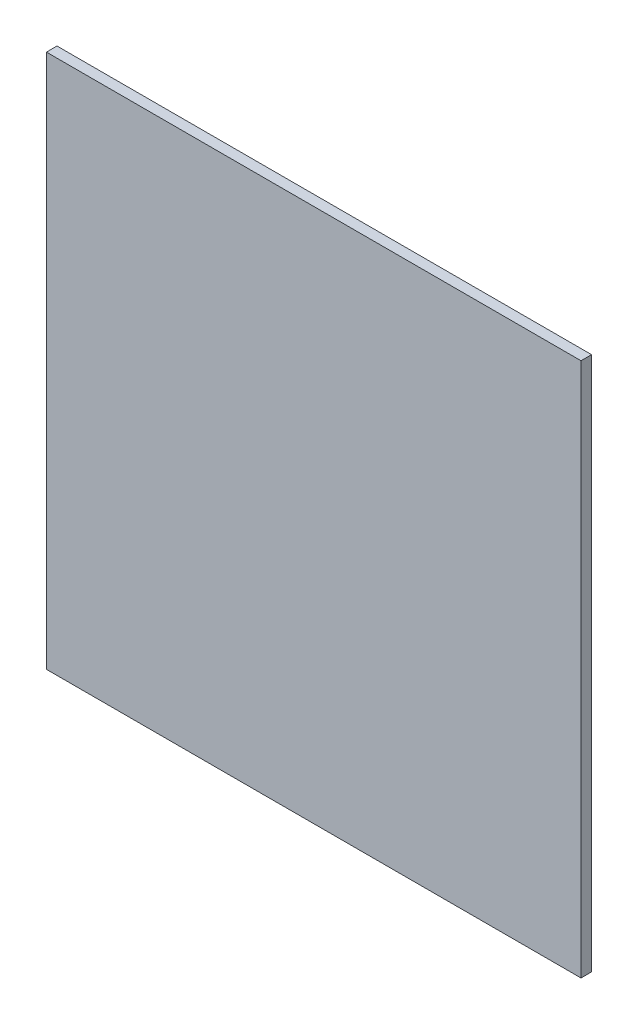
ISO-10303-21;
HEADER;
FILE_DESCRIPTION(('STEP AP214'),'2;1');
FILE_NAME('part.step','',(''),(''),'','','');
FILE_SCHEMA(('AUTOMOTIVE_DESIGN { 1 0 10303 214 1 1 1 1 }'));
ENDSEC;
DATA;
#1=APPLICATION_CONTEXT('core data for automotive mechanical design processes');
#2=APPLICATION_PROTOCOL_DEFINITION('international standard','automotive_design',2000,#1);
#3=PRODUCT_CONTEXT('',#1,'mechanical');
#4=PRODUCT('Part','Part','',(#3));
#5=PRODUCT_RELATED_PRODUCT_CATEGORY('part','',(#4));
#6=PRODUCT_DEFINITION_FORMATION('','',#4);
#7=PRODUCT_DEFINITION_CONTEXT('part definition',#1,'design');
#8=PRODUCT_DEFINITION('design','',#6,#7);
#9=PRODUCT_DEFINITION_SHAPE('','',#8);
#10=(LENGTH_UNIT() NAMED_UNIT(*) SI_UNIT(.MILLI.,.METRE.));
#11=(NAMED_UNIT(*) PLANE_ANGLE_UNIT() SI_UNIT($,.RADIAN.));
#12=(NAMED_UNIT(*) SI_UNIT($,.STERADIAN.) SOLID_ANGLE_UNIT());
#13=UNCERTAINTY_MEASURE_WITH_UNIT(LENGTH_MEASURE(1.E-05),#10,'distance_accuracy_value','');
#14=(GEOMETRIC_REPRESENTATION_CONTEXT(3) GLOBAL_UNCERTAINTY_ASSIGNED_CONTEXT((#13)) GLOBAL_UNIT_ASSIGNED_CONTEXT((#10,
#11,#12)) REPRESENTATION_CONTEXT('',''));
#15=CARTESIAN_POINT('',(0.,0.,0.));
#16=DIRECTION('',(0.,0.,1.));
#17=DIRECTION('',(1.,0.,0.));
#18=AXIS2_PLACEMENT_3D('',#15,#16,#17);
#19=CARTESIAN_POINT('',(120.65,-120.65,4.7625));
#20=DIRECTION('',(-1.,0.,0.));
#21=DIRECTION('',(0.,0.,1.));
#22=AXIS2_PLACEMENT_3D('',#19,#20,#21);
#23=PLANE('',#22);
#24=DIRECTION('',(0.,1.,0.));
#25=VECTOR('',#24,1.);
#26=CARTESIAN_POINT('',(120.65,-120.65,0.));
#27=LINE('',#26,#25);
#28=CARTESIAN_POINT('',(120.65,-120.65,0.));
#29=VERTEX_POINT('',#28);
#30=CARTESIAN_POINT('',(120.65,120.65,0.));
#31=VERTEX_POINT('',#30);
#32=EDGE_CURVE('E98',#29,#31,#27,.T.);
#33=ORIENTED_EDGE('',*,*,#32,.T.);
#34=DIRECTION('',(0.,0.,-1.));
#35=VECTOR('',#34,1.);
#36=CARTESIAN_POINT('',(120.65,120.65,4.7625));
#37=LINE('',#36,#35);
#38=CARTESIAN_POINT('',(120.65,120.65,4.7625));
#39=VERTEX_POINT('',#38);
#40=EDGE_CURVE('E11',#39,#31,#37,.T.);
#41=ORIENTED_EDGE('',*,*,#40,.F.);
#42=DIRECTION('',(0.,1.,0.));
#43=VECTOR('',#42,1.);
#44=CARTESIAN_POINT('',(120.65,-120.65,4.7625));
#45=LINE('',#44,#43);
#46=CARTESIAN_POINT('',(120.65,-120.65,4.7625));
#47=VERTEX_POINT('',#46);
#48=EDGE_CURVE('E86',#47,#39,#45,.T.);
#49=ORIENTED_EDGE('',*,*,#48,.F.);
#50=DIRECTION('',(0.,0.,-1.));
#51=VECTOR('',#50,1.);
#52=CARTESIAN_POINT('',(120.65,-120.65,4.7625));
#53=LINE('',#52,#51);
#54=EDGE_CURVE('E94',#47,#29,#53,.T.);
#55=ORIENTED_EDGE('',*,*,#54,.T.);
#56=EDGE_LOOP('',(#33,#41,#49,#55));
#57=FACE_BOUND('',#56,.T.);
#58=ADVANCED_FACE('F35',(#57),#23,.F.);
#59=CARTESIAN_POINT('',(-120.65,120.65,4.7625));
#60=DIRECTION('',(0.,-1.,0.));
#61=DIRECTION('',(0.,0.,-1.));
#62=AXIS2_PLACEMENT_3D('',#59,#60,#61);
#63=PLANE('',#62);
#64=DIRECTION('',(-1.,0.,0.));
#65=VECTOR('',#64,1.);
#66=CARTESIAN_POINT('',(-120.65,120.65,0.));
#67=LINE('',#66,#65);
#68=CARTESIAN_POINT('',(-120.65,120.65,0.));
#69=VERTEX_POINT('',#68);
#70=EDGE_CURVE('E90',#31,#69,#67,.T.);
#71=ORIENTED_EDGE('',*,*,#70,.T.);
#72=DIRECTION('',(0.,0.,-1.));
#73=VECTOR('',#72,1.);
#74=CARTESIAN_POINT('',(-120.65,120.65,4.7625));
#75=LINE('',#74,#73);
#76=CARTESIAN_POINT('',(-120.65,120.65,4.7625));
#77=VERTEX_POINT('',#76);
#78=EDGE_CURVE('E43',#77,#69,#75,.T.);
#79=ORIENTED_EDGE('',*,*,#78,.F.);
#80=DIRECTION('',(-1.,0.,0.));
#81=VECTOR('',#80,1.);
#82=CARTESIAN_POINT('',(-120.65,120.65,4.7625));
#83=LINE('',#82,#81);
#84=EDGE_CURVE('E81',#39,#77,#83,.T.);
#85=ORIENTED_EDGE('',*,*,#84,.F.);
#86=ORIENTED_EDGE('',*,*,#40,.T.);
#87=EDGE_LOOP('',(#71,#79,#85,#86));
#88=FACE_BOUND('',#87,.T.);
#89=ADVANCED_FACE('F89',(#88),#63,.F.);
#90=CARTESIAN_POINT('',(-120.65,-120.65,4.7625));
#91=DIRECTION('',(1.,0.,0.));
#92=DIRECTION('',(0.,0.,-1.));
#93=AXIS2_PLACEMENT_3D('',#90,#91,#92);
#94=PLANE('',#93);
#95=DIRECTION('',(0.,-1.,0.));
#96=VECTOR('',#95,1.);
#97=CARTESIAN_POINT('',(-120.65,-120.65,0.));
#98=LINE('',#97,#96);
#99=CARTESIAN_POINT('',(-120.65,-120.65,0.));
#100=VERTEX_POINT('',#99);
#101=EDGE_CURVE('E68',#69,#100,#98,.T.);
#102=ORIENTED_EDGE('',*,*,#101,.T.);
#103=DIRECTION('',(0.,0.,-1.));
#104=VECTOR('',#103,1.);
#105=CARTESIAN_POINT('',(-120.65,-120.65,4.7625));
#106=LINE('',#105,#104);
#107=CARTESIAN_POINT('',(-120.65,-120.65,4.7625));
#108=VERTEX_POINT('',#107);
#109=EDGE_CURVE('E91',#108,#100,#106,.T.);
#110=ORIENTED_EDGE('',*,*,#109,.F.);
#111=DIRECTION('',(0.,-1.,0.));
#112=VECTOR('',#111,1.);
#113=CARTESIAN_POINT('',(-120.65,-120.65,4.7625));
#114=LINE('',#113,#112);
#115=EDGE_CURVE('E84',#77,#108,#114,.T.);
#116=ORIENTED_EDGE('',*,*,#115,.F.);
#117=ORIENTED_EDGE('',*,*,#78,.T.);
#118=EDGE_LOOP('',(#102,#110,#116,#117));
#119=FACE_BOUND('',#118,.T.);
#120=ADVANCED_FACE('F92',(#119),#94,.F.);
#121=CARTESIAN_POINT('',(-120.65,-120.65,4.7625));
#122=DIRECTION('',(0.,1.,0.));
#123=DIRECTION('',(0.,0.,1.));
#124=AXIS2_PLACEMENT_3D('',#121,#122,#123);
#125=PLANE('',#124);
#126=DIRECTION('',(1.,0.,0.));
#127=VECTOR('',#126,1.);
#128=CARTESIAN_POINT('',(-120.65,-120.65,0.));
#129=LINE('',#128,#127);
#130=EDGE_CURVE('E74',#100,#29,#129,.T.);
#131=ORIENTED_EDGE('',*,*,#130,.T.);
#132=ORIENTED_EDGE('',*,*,#54,.F.);
#133=DIRECTION('',(1.,0.,0.));
#134=VECTOR('',#133,1.);
#135=CARTESIAN_POINT('',(-120.65,-120.65,4.7625));
#136=LINE('',#135,#134);
#137=EDGE_CURVE('E51',#108,#47,#136,.T.);
#138=ORIENTED_EDGE('',*,*,#137,.F.);
#139=ORIENTED_EDGE('',*,*,#109,.T.);
#140=EDGE_LOOP('',(#131,#132,#138,#139));
#141=FACE_BOUND('',#140,.T.);
#142=ADVANCED_FACE('F105',(#141),#125,.F.);
#143=CARTESIAN_POINT('',(0.,0.,4.7625));
#144=DIRECTION('',(0.,0.,-1.));
#145=DIRECTION('',(-1.,0.,0.));
#146=AXIS2_PLACEMENT_3D('',#143,#144,#145);
#147=PLANE('',#146);
#148=ORIENTED_EDGE('',*,*,#48,.T.);
#149=ORIENTED_EDGE('',*,*,#84,.T.);
#150=ORIENTED_EDGE('',*,*,#115,.T.);
#151=ORIENTED_EDGE('',*,*,#137,.T.);
#152=EDGE_LOOP('',(#148,#149,#150,#151));
#153=FACE_BOUND('',#152,.T.);
#154=ADVANCED_FACE('F82',(#153),#147,.F.);
#155=CARTESIAN_POINT('',(0.,0.,0.));
#156=DIRECTION('',(0.,0.,-1.));
#157=DIRECTION('',(-1.,0.,0.));
#158=AXIS2_PLACEMENT_3D('',#155,#156,#157);
#159=PLANE('',#158);
#160=ORIENTED_EDGE('',*,*,#32,.F.);
#161=ORIENTED_EDGE('',*,*,#130,.F.);
#162=ORIENTED_EDGE('',*,*,#101,.F.);
#163=ORIENTED_EDGE('',*,*,#70,.F.);
#164=EDGE_LOOP('',(#160,#161,#162,#163));
#165=FACE_BOUND('',#164,.T.);
#166=ADVANCED_FACE('F108',(#165),#159,.T.);
#167=CLOSED_SHELL('',(#58,#89,#120,#142,#154,#166));
#168=MANIFOLD_SOLID_BREP('B2',#167);
#169=ADVANCED_BREP_SHAPE_REPRESENTATION('',(#18,#168),#14);
#170=SHAPE_DEFINITION_REPRESENTATION(#9,#169);
ENDSEC;
END-ISO-10303-21;
